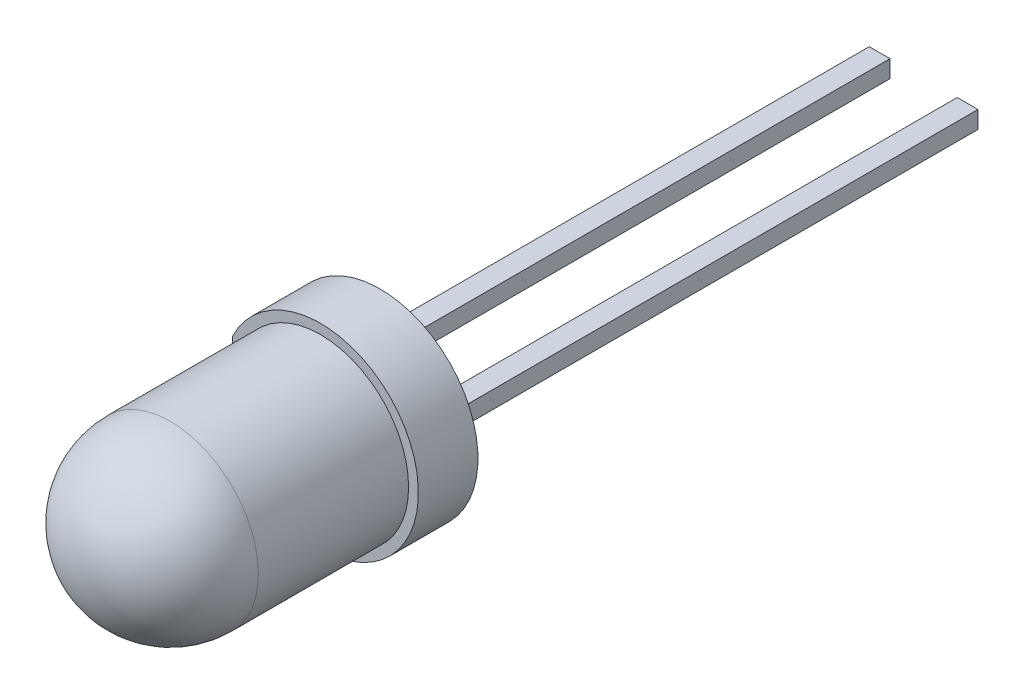
ISO-10303-21;
HEADER;
FILE_DESCRIPTION(('STEP AP214'),'2;1');
FILE_NAME('part.step','',(''),(''),'','','');
FILE_SCHEMA(('AUTOMOTIVE_DESIGN { 1 0 10303 214 1 1 1 1 }'));
ENDSEC;
DATA;
#1=APPLICATION_CONTEXT('core data for automotive mechanical design processes');
#2=APPLICATION_PROTOCOL_DEFINITION('international standard','automotive_design',2000,#1);
#3=PRODUCT_CONTEXT('',#1,'mechanical');
#4=PRODUCT('Part','Part','',(#3));
#5=PRODUCT_RELATED_PRODUCT_CATEGORY('part','',(#4));
#6=PRODUCT_DEFINITION_FORMATION('','',#4);
#7=PRODUCT_DEFINITION_CONTEXT('part definition',#1,'design');
#8=PRODUCT_DEFINITION('design','',#6,#7);
#9=PRODUCT_DEFINITION_SHAPE('','',#8);
#10=(LENGTH_UNIT() NAMED_UNIT(*) SI_UNIT(.MILLI.,.METRE.));
#11=(NAMED_UNIT(*) PLANE_ANGLE_UNIT() SI_UNIT($,.RADIAN.));
#12=(NAMED_UNIT(*) SI_UNIT($,.STERADIAN.) SOLID_ANGLE_UNIT());
#13=UNCERTAINTY_MEASURE_WITH_UNIT(LENGTH_MEASURE(1.E-05),#10,'distance_accuracy_value','');
#14=(GEOMETRIC_REPRESENTATION_CONTEXT(3) GLOBAL_UNCERTAINTY_ASSIGNED_CONTEXT((#13)) GLOBAL_UNIT_ASSIGNED_CONTEXT((#10,
#11,#12)) REPRESENTATION_CONTEXT('',''));
#15=CARTESIAN_POINT('',(0.,0.,0.));
#16=DIRECTION('',(0.,0.,1.));
#17=DIRECTION('',(1.,0.,0.));
#18=AXIS2_PLACEMENT_3D('',#15,#16,#17);
#19=CARTESIAN_POINT('',(-56.58,12.44,15.61));
#20=DIRECTION('',(0.,-1.,0.));
#21=DIRECTION('',(-1.,0.,0.));
#22=AXIS2_PLACEMENT_3D('',#19,#20,#21);
#23=PLANE('',#22);
#24=DIRECTION('',(0.,0.,-1.));
#25=VECTOR('',#24,1.);
#26=CARTESIAN_POINT('',(-56.28,12.44,15.61));
#27=LINE('',#26,#25);
#28=CARTESIAN_POINT('',(-56.28,12.44,31.57));
#29=VERTEX_POINT('',#28);
#30=CARTESIAN_POINT('',(-56.28,12.44,15.8775105573168));
#31=VERTEX_POINT('',#30);
#32=EDGE_CURVE('E11',#29,#31,#27,.T.);
#33=ORIENTED_EDGE('',*,*,#32,.T.);
#34=DIRECTION('',(1.,0.,0.));
#35=VECTOR('',#34,1.);
#36=CARTESIAN_POINT('',(-56.28,12.44,15.8775105573168));
#37=LINE('',#36,#35);
#38=CARTESIAN_POINT('',(-56.88,12.44,15.8775105573168));
#39=VERTEX_POINT('',#38);
#40=EDGE_CURVE('E152',#39,#31,#37,.T.);
#41=ORIENTED_EDGE('',*,*,#40,.F.);
#42=DIRECTION('',(0.,0.,-1.));
#43=VECTOR('',#42,1.);
#44=CARTESIAN_POINT('',(-56.88,12.44,15.61));
#45=LINE('',#44,#43);
#46=CARTESIAN_POINT('',(-56.88,12.44,31.57));
#47=VERTEX_POINT('',#46);
#48=EDGE_CURVE('E169',#47,#39,#45,.T.);
#49=ORIENTED_EDGE('',*,*,#48,.F.);
#50=DIRECTION('',(-1.,0.,0.));
#51=VECTOR('',#50,1.);
#52=CARTESIAN_POINT('',(-57.215,12.44,31.57));
#53=LINE('',#52,#51);
#54=EDGE_CURVE('E59',#29,#47,#53,.T.);
#55=ORIENTED_EDGE('',*,*,#54,.F.);
#56=EDGE_LOOP('',(#33,#41,#49,#55));
#57=FACE_BOUND('',#56,.T.);
#58=ADVANCED_FACE('F40',(#57),#23,.F.);
#59=CARTESIAN_POINT('',(-56.28,12.19,15.61));
#60=DIRECTION('',(-1.,0.,0.));
#61=DIRECTION('',(0.,-1.,0.));
#62=AXIS2_PLACEMENT_3D('',#59,#60,#61);
#63=PLANE('',#62);
#64=DIRECTION('',(0.,0.,-1.));
#65=VECTOR('',#64,1.);
#66=CARTESIAN_POINT('',(-56.28,11.94,15.61));
#67=LINE('',#66,#65);
#68=CARTESIAN_POINT('',(-56.28,11.94,31.57));
#69=VERTEX_POINT('',#68);
#70=CARTESIAN_POINT('',(-56.28,11.94,15.8775105573168));
#71=VERTEX_POINT('',#70);
#72=EDGE_CURVE('E50',#69,#71,#67,.T.);
#73=ORIENTED_EDGE('',*,*,#72,.T.);
#74=DIRECTION('',(0.,-1.,0.));
#75=VECTOR('',#74,1.);
#76=CARTESIAN_POINT('',(-56.28,12.44,15.8775105573168));
#77=LINE('',#76,#75);
#78=EDGE_CURVE('E232',#31,#71,#77,.T.);
#79=ORIENTED_EDGE('',*,*,#78,.F.);
#80=ORIENTED_EDGE('',*,*,#32,.F.);
#81=DIRECTION('',(0.,1.,0.));
#82=VECTOR('',#81,1.);
#83=CARTESIAN_POINT('',(-56.28,12.19,31.57));
#84=LINE('',#83,#82);
#85=EDGE_CURVE('E155',#69,#29,#84,.T.);
#86=ORIENTED_EDGE('',*,*,#85,.F.);
#87=EDGE_LOOP('',(#73,#79,#80,#86));
#88=FACE_BOUND('',#87,.T.);
#89=ADVANCED_FACE('F255',(#88),#63,.F.);
#90=CARTESIAN_POINT('',(-56.58,11.94,15.61));
#91=DIRECTION('',(0.,1.,0.));
#92=DIRECTION('',(0.,0.,-1.));
#93=AXIS2_PLACEMENT_3D('',#90,#91,#92);
#94=PLANE('',#93);
#95=DIRECTION('',(0.,0.,-1.));
#96=VECTOR('',#95,1.);
#97=CARTESIAN_POINT('',(-56.88,11.94,15.61));
#98=LINE('',#97,#96);
#99=CARTESIAN_POINT('',(-56.88,11.94,31.57));
#100=VERTEX_POINT('',#99);
#101=CARTESIAN_POINT('',(-56.88,11.94,15.8775105573168));
#102=VERTEX_POINT('',#101);
#103=EDGE_CURVE('E167',#100,#102,#98,.T.);
#104=ORIENTED_EDGE('',*,*,#103,.T.);
#105=DIRECTION('',(-1.,0.,0.));
#106=VECTOR('',#105,1.);
#107=CARTESIAN_POINT('',(-56.28,11.94,15.8775105573168));
#108=LINE('',#107,#106);
#109=EDGE_CURVE('E235',#71,#102,#108,.T.);
#110=ORIENTED_EDGE('',*,*,#109,.F.);
#111=ORIENTED_EDGE('',*,*,#72,.F.);
#112=DIRECTION('',(1.,0.,0.));
#113=VECTOR('',#112,1.);
#114=CARTESIAN_POINT('',(-57.215,11.94,31.57));
#115=LINE('',#114,#113);
#116=EDGE_CURVE('E157',#100,#69,#115,.T.);
#117=ORIENTED_EDGE('',*,*,#116,.F.);
#118=EDGE_LOOP('',(#104,#110,#111,#117));
#119=FACE_BOUND('',#118,.T.);
#120=ADVANCED_FACE('F244',(#119),#94,.F.);
#121=CARTESIAN_POINT('',(-56.88,12.19,15.61));
#122=DIRECTION('',(1.,0.,0.));
#123=DIRECTION('',(0.,0.,1.));
#124=AXIS2_PLACEMENT_3D('',#121,#122,#123);
#125=PLANE('',#124);
#126=ORIENTED_EDGE('',*,*,#48,.T.);
#127=DIRECTION('',(0.,1.,0.));
#128=VECTOR('',#127,1.);
#129=CARTESIAN_POINT('',(-56.88,12.44,15.8775105573168));
#130=LINE('',#129,#128);
#131=EDGE_CURVE('E237',#102,#39,#130,.T.);
#132=ORIENTED_EDGE('',*,*,#131,.F.);
#133=ORIENTED_EDGE('',*,*,#103,.F.);
#134=DIRECTION('',(0.,-1.,0.));
#135=VECTOR('',#134,1.);
#136=CARTESIAN_POINT('',(-56.88,12.19,31.57));
#137=LINE('',#136,#135);
#138=EDGE_CURVE('E162',#47,#100,#137,.T.);
#139=ORIENTED_EDGE('',*,*,#138,.F.);
#140=EDGE_LOOP('',(#126,#132,#133,#139));
#141=FACE_BOUND('',#140,.T.);
#142=ADVANCED_FACE('F245',(#141),#125,.F.);
#143=CARTESIAN_POINT('',(-59.12,12.44,15.61));
#144=DIRECTION('',(0.,-1.,0.));
#145=DIRECTION('',(-1.,0.,0.));
#146=AXIS2_PLACEMENT_3D('',#143,#144,#145);
#147=PLANE('',#146);
#148=DIRECTION('',(0.,0.,-1.));
#149=VECTOR('',#148,1.);
#150=CARTESIAN_POINT('',(-58.82,12.44,15.61));
#151=LINE('',#150,#149);
#152=CARTESIAN_POINT('',(-58.82,12.44,31.57));
#153=VERTEX_POINT('',#152);
#154=CARTESIAN_POINT('',(-58.82,12.44,15.8775105573168));
#155=VERTEX_POINT('',#154);
#156=EDGE_CURVE('E165',#153,#155,#151,.T.);
#157=ORIENTED_EDGE('',*,*,#156,.T.);
#158=DIRECTION('',(1.,0.,0.));
#159=VECTOR('',#158,1.);
#160=CARTESIAN_POINT('',(-58.82,12.44,15.8775105573168));
#161=LINE('',#160,#159);
#162=CARTESIAN_POINT('',(-59.42,12.44,15.8775105573168));
#163=VERTEX_POINT('',#162);
#164=EDGE_CURVE('E206',#163,#155,#161,.T.);
#165=ORIENTED_EDGE('',*,*,#164,.F.);
#166=DIRECTION('',(0.,0.,-1.));
#167=VECTOR('',#166,1.);
#168=CARTESIAN_POINT('',(-59.42,12.44,15.61));
#169=LINE('',#168,#167);
#170=CARTESIAN_POINT('',(-59.42,12.44,31.57));
#171=VERTEX_POINT('',#170);
#172=EDGE_CURVE('E190',#171,#163,#169,.T.);
#173=ORIENTED_EDGE('',*,*,#172,.F.);
#174=DIRECTION('',(-1.,0.,0.));
#175=VECTOR('',#174,1.);
#176=CARTESIAN_POINT('',(-58.485,12.44,31.57));
#177=LINE('',#176,#175);
#178=EDGE_CURVE('E108',#153,#171,#177,.T.);
#179=ORIENTED_EDGE('',*,*,#178,.F.);
#180=EDGE_LOOP('',(#157,#165,#173,#179));
#181=FACE_BOUND('',#180,.T.);
#182=ADVANCED_FACE('F203',(#181),#147,.F.);
#183=CARTESIAN_POINT('',(-58.82,12.19,15.61));
#184=DIRECTION('',(-1.,0.,0.));
#185=DIRECTION('',(0.,-1.,0.));
#186=AXIS2_PLACEMENT_3D('',#183,#184,#185);
#187=PLANE('',#186);
#188=DIRECTION('',(0.,0.,-1.));
#189=VECTOR('',#188,1.);
#190=CARTESIAN_POINT('',(-58.82,11.94,15.61));
#191=LINE('',#190,#189);
#192=CARTESIAN_POINT('',(-58.82,11.94,31.57));
#193=VERTEX_POINT('',#192);
#194=CARTESIAN_POINT('',(-58.82,11.94,15.8775105573168));
#195=VERTEX_POINT('',#194);
#196=EDGE_CURVE('E164',#193,#195,#191,.T.);
#197=ORIENTED_EDGE('',*,*,#196,.T.);
#198=DIRECTION('',(0.,-1.,0.));
#199=VECTOR('',#198,1.);
#200=CARTESIAN_POINT('',(-58.82,12.44,15.8775105573168));
#201=LINE('',#200,#199);
#202=EDGE_CURVE('E226',#155,#195,#201,.T.);
#203=ORIENTED_EDGE('',*,*,#202,.F.);
#204=ORIENTED_EDGE('',*,*,#156,.F.);
#205=DIRECTION('',(0.,1.,0.));
#206=VECTOR('',#205,1.);
#207=CARTESIAN_POINT('',(-58.82,12.19,31.57));
#208=LINE('',#207,#206);
#209=EDGE_CURVE('E115',#193,#153,#208,.T.);
#210=ORIENTED_EDGE('',*,*,#209,.F.);
#211=EDGE_LOOP('',(#197,#203,#204,#210));
#212=FACE_BOUND('',#211,.T.);
#213=ADVANCED_FACE('F261',(#212),#187,.F.);
#214=CARTESIAN_POINT('',(-59.12,11.94,15.61));
#215=DIRECTION('',(0.,1.,0.));
#216=DIRECTION('',(0.,0.,-1.));
#217=AXIS2_PLACEMENT_3D('',#214,#215,#216);
#218=PLANE('',#217);
#219=DIRECTION('',(0.,0.,-1.));
#220=VECTOR('',#219,1.);
#221=CARTESIAN_POINT('',(-59.42,11.94,15.61));
#222=LINE('',#221,#220);
#223=CARTESIAN_POINT('',(-59.42,11.94,31.57));
#224=VERTEX_POINT('',#223);
#225=CARTESIAN_POINT('',(-59.42,11.94,15.8775105573168));
#226=VERTEX_POINT('',#225);
#227=EDGE_CURVE('E166',#224,#226,#222,.T.);
#228=ORIENTED_EDGE('',*,*,#227,.T.);
#229=DIRECTION('',(-1.,0.,0.));
#230=VECTOR('',#229,1.);
#231=CARTESIAN_POINT('',(-58.82,11.94,15.8775105573168));
#232=LINE('',#231,#230);
#233=EDGE_CURVE('E220',#195,#226,#232,.T.);
#234=ORIENTED_EDGE('',*,*,#233,.F.);
#235=ORIENTED_EDGE('',*,*,#196,.F.);
#236=DIRECTION('',(1.,0.,0.));
#237=VECTOR('',#236,1.);
#238=CARTESIAN_POINT('',(-58.485,11.94,31.57));
#239=LINE('',#238,#237);
#240=EDGE_CURVE('E147',#224,#193,#239,.T.);
#241=ORIENTED_EDGE('',*,*,#240,.F.);
#242=EDGE_LOOP('',(#228,#234,#235,#241));
#243=FACE_BOUND('',#242,.T.);
#244=ADVANCED_FACE('F218',(#243),#218,.F.);
#245=CARTESIAN_POINT('',(-59.42,12.19,15.61));
#246=DIRECTION('',(1.,0.,0.));
#247=DIRECTION('',(0.,0.,1.));
#248=AXIS2_PLACEMENT_3D('',#245,#246,#247);
#249=PLANE('',#248);
#250=ORIENTED_EDGE('',*,*,#172,.T.);
#251=DIRECTION('',(0.,1.,0.));
#252=VECTOR('',#251,1.);
#253=CARTESIAN_POINT('',(-59.42,12.44,15.8775105573168));
#254=LINE('',#253,#252);
#255=EDGE_CURVE('E214',#226,#163,#254,.T.);
#256=ORIENTED_EDGE('',*,*,#255,.F.);
#257=ORIENTED_EDGE('',*,*,#227,.F.);
#258=DIRECTION('',(0.,-1.,0.));
#259=VECTOR('',#258,1.);
#260=CARTESIAN_POINT('',(-59.42,12.19,31.57));
#261=LINE('',#260,#259);
#262=EDGE_CURVE('E194',#171,#224,#261,.T.);
#263=ORIENTED_EDGE('',*,*,#262,.F.);
#264=EDGE_LOOP('',(#250,#256,#257,#263));
#265=FACE_BOUND('',#264,.T.);
#266=ADVANCED_FACE('F212',(#265),#249,.F.);
#267=CARTESIAN_POINT('',(-60.3925,12.19,32.43));
#268=DIRECTION('',(-1.,0.,0.));
#269=DIRECTION('',(0.,-1.,0.));
#270=AXIS2_PLACEMENT_3D('',#267,#268,#269);
#271=PLANE('',#270);
#272=DIRECTION('',(0.,0.,1.));
#273=VECTOR('',#272,1.);
#274=CARTESIAN_POINT('',(-60.3925,13.4213889515502,32.43));
#275=LINE('',#274,#273);
#276=CARTESIAN_POINT('',(-60.3925,13.4213889515502,31.57));
#277=VERTEX_POINT('',#276);
#278=CARTESIAN_POINT('',(-60.3925,13.4213889515502,33.29));
#279=VERTEX_POINT('',#278);
#280=EDGE_CURVE('E135',#277,#279,#275,.T.);
#281=ORIENTED_EDGE('',*,*,#280,.F.);
#282=DIRECTION('',(0.,1.,0.));
#283=VECTOR('',#282,1.);
#284=CARTESIAN_POINT('',(-60.3925,12.19,31.57));
#285=LINE('',#284,#283);
#286=CARTESIAN_POINT('',(-60.3925,10.9586110484498,31.57));
#287=VERTEX_POINT('',#286);
#288=EDGE_CURVE('E125',#287,#277,#285,.T.);
#289=ORIENTED_EDGE('',*,*,#288,.F.);
#290=DIRECTION('',(0.,0.,-1.));
#291=VECTOR('',#290,1.);
#292=CARTESIAN_POINT('',(-60.3925,10.9586110484498,32.43));
#293=LINE('',#292,#291);
#294=CARTESIAN_POINT('',(-60.3925,10.9586110484498,33.29));
#295=VERTEX_POINT('',#294);
#296=EDGE_CURVE('E141',#295,#287,#293,.T.);
#297=ORIENTED_EDGE('',*,*,#296,.F.);
#298=DIRECTION('',(0.,-1.,0.));
#299=VECTOR('',#298,1.);
#300=CARTESIAN_POINT('',(-60.3925,12.19,33.29));
#301=LINE('',#300,#299);
#302=CARTESIAN_POINT('',(-60.3925,12.19,33.29));
#303=VERTEX_POINT('',#302);
#304=EDGE_CURVE('E160',#303,#295,#301,.T.);
#305=ORIENTED_EDGE('',*,*,#304,.F.);
#306=DIRECTION('',(0.,-1.,0.));
#307=VECTOR('',#306,1.);
#308=CARTESIAN_POINT('',(-60.3925,12.19,33.29));
#309=LINE('',#308,#307);
#310=EDGE_CURVE('E44',#279,#303,#309,.T.);
#311=ORIENTED_EDGE('',*,*,#310,.F.);
#312=EDGE_LOOP('',(#281,#289,#297,#305,#311));
#313=FACE_BOUND('',#312,.T.);
#314=ADVANCED_FACE('F136',(#313),#271,.T.);
#315=CARTESIAN_POINT('',(-57.85,12.19,33.29));
#316=DIRECTION('',(0.,0.,1.));
#317=DIRECTION('',(-1.,0.,0.));
#318=AXIS2_PLACEMENT_3D('',#315,#316,#317);
#319=PLANE('',#318);
#320=ORIENTED_EDGE('',*,*,#310,.T.);
#321=CARTESIAN_POINT('',(-57.85,12.19,33.29));
#322=DIRECTION('',(0.,0.,-1.));
#323=DIRECTION('',(-1.,0.,0.));
#324=AXIS2_PLACEMENT_3D('',#321,#322,#323);
#325=CIRCLE('',#324,2.5425);
#326=CARTESIAN_POINT('',(-55.3075,12.19,33.29));
#327=VERTEX_POINT('',#326);
#328=EDGE_CURVE('E153',#303,#327,#325,.T.);
#329=ORIENTED_EDGE('',*,*,#328,.T.);
#330=CARTESIAN_POINT('',(-57.85,12.19,33.29));
#331=DIRECTION('',(0.,0.,-1.));
#332=DIRECTION('',(-1.,0.,0.));
#333=AXIS2_PLACEMENT_3D('',#330,#331,#332);
#334=CIRCLE('',#333,2.5425);
#335=EDGE_CURVE('E90',#327,#303,#334,.T.);
#336=ORIENTED_EDGE('',*,*,#335,.T.);
#337=ORIENTED_EDGE('',*,*,#304,.T.);
#338=CARTESIAN_POINT('',(-57.85,12.19,33.29));
#339=DIRECTION('',(0.,0.,1.));
#340=DIRECTION('',(-1.,0.,0.));
#341=AXIS2_PLACEMENT_3D('',#338,#339,#340);
#342=CIRCLE('',#341,2.825);
#343=EDGE_CURVE('E158',#295,#279,#342,.T.);
#344=ORIENTED_EDGE('',*,*,#343,.T.);
#345=EDGE_LOOP('',(#320,#329,#336,#337,#344));
#346=FACE_BOUND('',#345,.T.);
#347=ADVANCED_FACE('F42',(#346),#319,.T.);
#348=CARTESIAN_POINT('',(-57.85,12.19,37.6275));
#349=DIRECTION('',(0.,0.,1.));
#350=DIRECTION('',(-1.,0.,0.));
#351=AXIS2_PLACEMENT_3D('',#348,#349,#350);
#352=SPHERICAL_SURFACE('',#351,2.5425);
#353=CARTESIAN_POINT('',(-57.85,12.19,37.6275));
#354=DIRECTION('',(0.,0.,1.));
#355=DIRECTION('',(-1.,0.,0.));
#356=AXIS2_PLACEMENT_3D('',#353,#354,#355);
#357=CIRCLE('',#356,2.5425);
#358=CARTESIAN_POINT('',(-55.3075,12.19,37.6275));
#359=VERTEX_POINT('',#358);
#360=EDGE_CURVE('E161',#359,#359,#357,.T.);
#361=ORIENTED_EDGE('',*,*,#360,.T.);
#362=CARTESIAN_POINT('',(-57.85,12.19,37.6275));
#363=DIRECTION('',(0.,1.,0.));
#364=DIRECTION('',(1.,0.,0.));
#365=AXIS2_PLACEMENT_3D('',#362,#363,#364);
#366=CIRCLE('',#365,2.5425);
#367=CARTESIAN_POINT('',(-57.85,12.19,40.17));
#368=VERTEX_POINT('',#367);
#369=EDGE_CURVE('E97',#368,#359,#366,.T.);
#370=ORIENTED_EDGE('',*,*,#369,.F.);
#371=ORIENTED_EDGE('',*,*,#369,.T.);
#372=EDGE_LOOP('',(#361,#370,#371));
#373=FACE_BOUND('',#372,.T.);
#374=ADVANCED_FACE('F283',(#373),#352,.T.);
#375=CARTESIAN_POINT('',(-57.85,12.19,32.43));
#376=DIRECTION('',(0.,0.,1.));
#377=DIRECTION('',(1.,0.,0.));
#378=AXIS2_PLACEMENT_3D('',#375,#376,#377);
#379=CYLINDRICAL_SURFACE('',#378,2.825);
#380=ORIENTED_EDGE('',*,*,#280,.T.);
#381=ORIENTED_EDGE('',*,*,#343,.F.);
#382=ORIENTED_EDGE('',*,*,#296,.T.);
#383=CARTESIAN_POINT('',(-57.85,12.19,31.57));
#384=DIRECTION('',(0.,0.,-1.));
#385=DIRECTION('',(-1.,0.,0.));
#386=AXIS2_PLACEMENT_3D('',#383,#384,#385);
#387=CIRCLE('',#386,2.825);
#388=EDGE_CURVE('E129',#277,#287,#387,.T.);
#389=ORIENTED_EDGE('',*,*,#388,.F.);
#390=EDGE_LOOP('',(#380,#381,#382,#389));
#391=FACE_BOUND('',#390,.T.);
#392=ADVANCED_FACE('F143',(#391),#379,.T.);
#393=CARTESIAN_POINT('',(-57.85,12.19,31.57));
#394=DIRECTION('',(0.,0.,-1.));
#395=DIRECTION('',(0.,1.,0.));
#396=AXIS2_PLACEMENT_3D('',#393,#394,#395);
#397=PLANE('',#396);
#398=ORIENTED_EDGE('',*,*,#388,.T.);
#399=ORIENTED_EDGE('',*,*,#288,.T.);
#400=EDGE_LOOP('',(#398,#399));
#401=FACE_BOUND('',#400,.T.);
#402=ORIENTED_EDGE('',*,*,#54,.T.);
#403=ORIENTED_EDGE('',*,*,#138,.T.);
#404=ORIENTED_EDGE('',*,*,#116,.T.);
#405=ORIENTED_EDGE('',*,*,#85,.T.);
#406=EDGE_LOOP('',(#402,#403,#404,#405));
#407=FACE_BOUND('',#406,.T.);
#408=ORIENTED_EDGE('',*,*,#178,.T.);
#409=ORIENTED_EDGE('',*,*,#262,.T.);
#410=ORIENTED_EDGE('',*,*,#240,.T.);
#411=ORIENTED_EDGE('',*,*,#209,.T.);
#412=EDGE_LOOP('',(#408,#409,#410,#411));
#413=FACE_BOUND('',#412,.T.);
#414=ADVANCED_FACE('F127',(#401,#407,#413),#397,.T.);
#415=CARTESIAN_POINT('',(-57.85,12.19,35.45875));
#416=DIRECTION('',(0.,0.,1.));
#417=DIRECTION('',(-1.,0.,0.));
#418=AXIS2_PLACEMENT_3D('',#415,#416,#417);
#419=CYLINDRICAL_SURFACE('',#418,2.5425);
#420=ORIENTED_EDGE('',*,*,#360,.F.);
#421=DIRECTION('',(0.,0.,-1.));
#422=VECTOR('',#421,1.);
#423=CARTESIAN_POINT('',(-55.3075,12.19,35.45875));
#424=LINE('',#423,#422);
#425=EDGE_CURVE('E149',#359,#327,#424,.T.);
#426=ORIENTED_EDGE('',*,*,#425,.T.);
#427=ORIENTED_EDGE('',*,*,#328,.F.);
#428=ORIENTED_EDGE('',*,*,#335,.F.);
#429=ORIENTED_EDGE('',*,*,#425,.F.);
#430=EDGE_LOOP('',(#420,#426,#427,#428,#429));
#431=FACE_BOUND('',#430,.T.);
#432=ADVANCED_FACE('F282',(#431),#419,.T.);
#433=CARTESIAN_POINT('',(0.,0.,15.8775105573168));
#434=DIRECTION('',(0.,0.,-1.));
#435=DIRECTION('',(-1.,0.,0.));
#436=AXIS2_PLACEMENT_3D('',#433,#434,#435);
#437=PLANE('',#436);
#438=ORIENTED_EDGE('',*,*,#78,.T.);
#439=ORIENTED_EDGE('',*,*,#109,.T.);
#440=ORIENTED_EDGE('',*,*,#131,.T.);
#441=ORIENTED_EDGE('',*,*,#40,.T.);
#442=EDGE_LOOP('',(#438,#439,#440,#441));
#443=FACE_BOUND('',#442,.T.);
#444=ADVANCED_FACE('F250',(#443),#437,.T.);
#445=CARTESIAN_POINT('',(0.,0.,15.8775105573168));
#446=DIRECTION('',(0.,0.,-1.));
#447=DIRECTION('',(-1.,0.,0.));
#448=AXIS2_PLACEMENT_3D('',#445,#446,#447);
#449=PLANE('',#448);
#450=ORIENTED_EDGE('',*,*,#202,.T.);
#451=ORIENTED_EDGE('',*,*,#233,.T.);
#452=ORIENTED_EDGE('',*,*,#255,.T.);
#453=ORIENTED_EDGE('',*,*,#164,.T.);
#454=EDGE_LOOP('',(#450,#451,#452,#453));
#455=FACE_BOUND('',#454,.T.);
#456=ADVANCED_FACE('F224',(#455),#449,.T.);
#457=CLOSED_SHELL('',(#58,#89,#120,#142,#182,#213,#244,#266,#314,#347,#374,#392,#414,#432,#444,#456));
#458=MANIFOLD_SOLID_BREP('B2',#457);
#459=ADVANCED_BREP_SHAPE_REPRESENTATION('',(#18,#458),#14);
#460=SHAPE_DEFINITION_REPRESENTATION(#9,#459);
ENDSEC;
END-ISO-10303-21;
